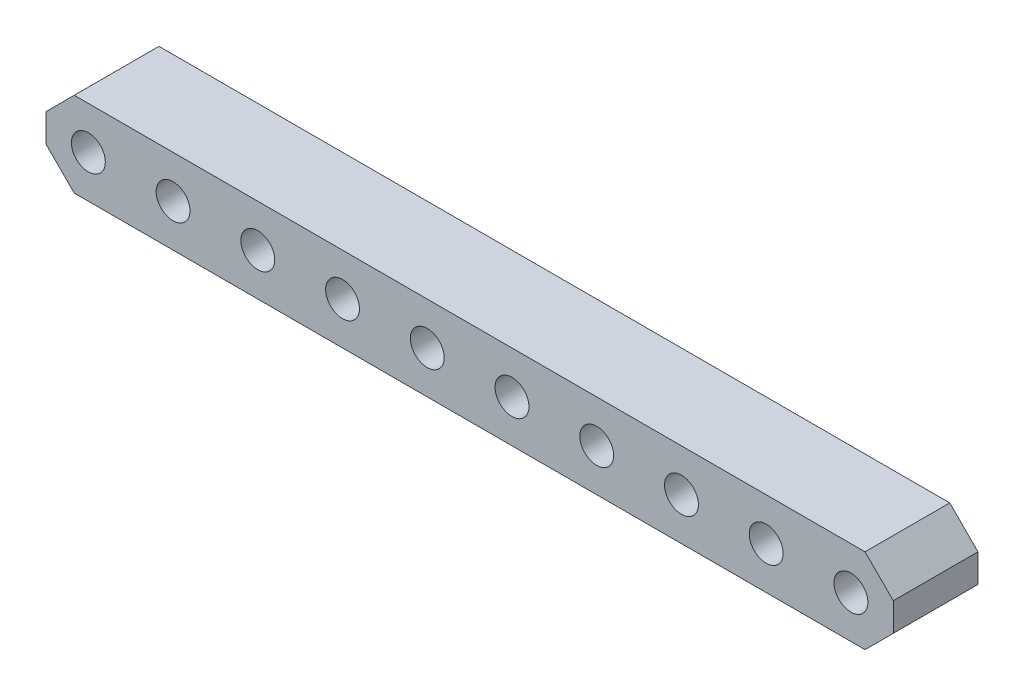
ISO-10303-21;
HEADER;
FILE_DESCRIPTION(('STEP AP214'),'2;1');
FILE_NAME('part.step','',(''),(''),'','','');
FILE_SCHEMA(('AUTOMOTIVE_DESIGN { 1 0 10303 214 1 1 1 1 }'));
ENDSEC;
DATA;
#1=APPLICATION_CONTEXT('core data for automotive mechanical design processes');
#2=APPLICATION_PROTOCOL_DEFINITION('international standard','automotive_design',2000,#1);
#3=PRODUCT_CONTEXT('',#1,'mechanical');
#4=PRODUCT('Part','Part','',(#3));
#5=PRODUCT_RELATED_PRODUCT_CATEGORY('part','',(#4));
#6=PRODUCT_DEFINITION_FORMATION('','',#4);
#7=PRODUCT_DEFINITION_CONTEXT('part definition',#1,'design');
#8=PRODUCT_DEFINITION('design','',#6,#7);
#9=PRODUCT_DEFINITION_SHAPE('','',#8);
#10=(LENGTH_UNIT() NAMED_UNIT(*) SI_UNIT(.MILLI.,.METRE.));
#11=(NAMED_UNIT(*) PLANE_ANGLE_UNIT() SI_UNIT($,.RADIAN.));
#12=(NAMED_UNIT(*) SI_UNIT($,.STERADIAN.) SOLID_ANGLE_UNIT());
#13=UNCERTAINTY_MEASURE_WITH_UNIT(LENGTH_MEASURE(1.E-05),#10,'distance_accuracy_value','');
#14=(GEOMETRIC_REPRESENTATION_CONTEXT(3) GLOBAL_UNCERTAINTY_ASSIGNED_CONTEXT((#13)) GLOBAL_UNIT_ASSIGNED_CONTEXT((#10,
#11,#12)) REPRESENTATION_CONTEXT('',''));
#15=CARTESIAN_POINT('',(0.,0.,0.));
#16=DIRECTION('',(0.,0.,1.));
#17=DIRECTION('',(1.,0.,0.));
#18=AXIS2_PLACEMENT_3D('',#15,#16,#17);
#19=CARTESIAN_POINT('',(0.,0.,18.));
#20=DIRECTION('',(0.,0.,1.));
#21=DIRECTION('',(1.,0.,0.));
#22=AXIS2_PLACEMENT_3D('',#19,#20,#21);
#23=PLANE('',#22);
#24=CARTESIAN_POINT('',(15.,0.,18.));
#25=DIRECTION('',(0.,0.,1.));
#26=DIRECTION('',(1.,0.,0.));
#27=AXIS2_PLACEMENT_3D('',#24,#25,#26);
#28=CIRCLE('',#27,6.);
#29=CARTESIAN_POINT('',(21.,0.,18.));
#30=VERTEX_POINT('',#29);
#31=EDGE_CURVE('E20',#30,#30,#28,.T.);
#32=ORIENTED_EDGE('',*,*,#31,.T.);
#33=EDGE_LOOP('',(#32));
#34=FACE_BOUND('',#33,.T.);
#35=ADVANCED_FACE('F17',(#34),#23,.T.);
#36=CARTESIAN_POINT('',(0.,0.,18.));
#37=DIRECTION('',(0.,0.,1.));
#38=DIRECTION('',(1.,0.,0.));
#39=AXIS2_PLACEMENT_3D('',#36,#37,#38);
#40=PLANE('',#39);
#41=CARTESIAN_POINT('',(45.,0.,18.));
#42=DIRECTION('',(0.,0.,1.));
#43=DIRECTION('',(1.,0.,0.));
#44=AXIS2_PLACEMENT_3D('',#41,#42,#43);
#45=CIRCLE('',#44,6.);
#46=CARTESIAN_POINT('',(51.,0.,18.));
#47=VERTEX_POINT('',#46);
#48=EDGE_CURVE('E161',#47,#47,#45,.T.);
#49=ORIENTED_EDGE('',*,*,#48,.T.);
#50=EDGE_LOOP('',(#49));
#51=FACE_BOUND('',#50,.T.);
#52=ADVANCED_FACE('F263',(#51),#40,.T.);
#53=CARTESIAN_POINT('',(0.,0.,18.));
#54=DIRECTION('',(0.,0.,1.));
#55=DIRECTION('',(1.,0.,0.));
#56=AXIS2_PLACEMENT_3D('',#53,#54,#55);
#57=PLANE('',#56);
#58=CARTESIAN_POINT('',(75.,0.,18.));
#59=DIRECTION('',(0.,0.,1.));
#60=DIRECTION('',(1.,0.,0.));
#61=AXIS2_PLACEMENT_3D('',#58,#59,#60);
#62=CIRCLE('',#61,6.);
#63=CARTESIAN_POINT('',(81.,0.,18.));
#64=VERTEX_POINT('',#63);
#65=EDGE_CURVE('E159',#64,#64,#62,.T.);
#66=ORIENTED_EDGE('',*,*,#65,.T.);
#67=EDGE_LOOP('',(#66));
#68=FACE_BOUND('',#67,.T.);
#69=ADVANCED_FACE('F260',(#68),#57,.T.);
#70=CARTESIAN_POINT('',(0.,0.,18.));
#71=DIRECTION('',(0.,0.,1.));
#72=DIRECTION('',(1.,0.,0.));
#73=AXIS2_PLACEMENT_3D('',#70,#71,#72);
#74=PLANE('',#73);
#75=CARTESIAN_POINT('',(105.,0.,18.));
#76=DIRECTION('',(0.,0.,1.));
#77=DIRECTION('',(1.,0.,0.));
#78=AXIS2_PLACEMENT_3D('',#75,#76,#77);
#79=CIRCLE('',#78,6.);
#80=CARTESIAN_POINT('',(111.,0.,18.));
#81=VERTEX_POINT('',#80);
#82=EDGE_CURVE('E156',#81,#81,#79,.T.);
#83=ORIENTED_EDGE('',*,*,#82,.T.);
#84=EDGE_LOOP('',(#83));
#85=FACE_BOUND('',#84,.T.);
#86=ADVANCED_FACE('F262',(#85),#74,.T.);
#87=CARTESIAN_POINT('',(0.,0.,18.));
#88=DIRECTION('',(0.,0.,1.));
#89=DIRECTION('',(1.,0.,0.));
#90=AXIS2_PLACEMENT_3D('',#87,#88,#89);
#91=PLANE('',#90);
#92=CARTESIAN_POINT('',(135.,0.,18.));
#93=DIRECTION('',(0.,0.,1.));
#94=DIRECTION('',(1.,0.,0.));
#95=AXIS2_PLACEMENT_3D('',#92,#93,#94);
#96=CIRCLE('',#95,6.);
#97=CARTESIAN_POINT('',(141.,0.,18.));
#98=VERTEX_POINT('',#97);
#99=EDGE_CURVE('E153',#98,#98,#96,.T.);
#100=ORIENTED_EDGE('',*,*,#99,.T.);
#101=EDGE_LOOP('',(#100));
#102=FACE_BOUND('',#101,.T.);
#103=ADVANCED_FACE('F269',(#102),#91,.T.);
#104=CARTESIAN_POINT('',(0.,0.,18.));
#105=DIRECTION('',(0.,0.,1.));
#106=DIRECTION('',(1.,0.,0.));
#107=AXIS2_PLACEMENT_3D('',#104,#105,#106);
#108=PLANE('',#107);
#109=CARTESIAN_POINT('',(-15.,0.,18.));
#110=DIRECTION('',(0.,0.,1.));
#111=DIRECTION('',(1.,0.,0.));
#112=AXIS2_PLACEMENT_3D('',#109,#110,#111);
#113=CIRCLE('',#112,6.);
#114=CARTESIAN_POINT('',(-9.,0.,18.));
#115=VERTEX_POINT('',#114);
#116=EDGE_CURVE('E150',#115,#115,#113,.T.);
#117=ORIENTED_EDGE('',*,*,#116,.T.);
#118=EDGE_LOOP('',(#117));
#119=FACE_BOUND('',#118,.T.);
#120=ADVANCED_FACE('F275',(#119),#108,.T.);
#121=CARTESIAN_POINT('',(0.,0.,18.));
#122=DIRECTION('',(0.,0.,1.));
#123=DIRECTION('',(1.,0.,0.));
#124=AXIS2_PLACEMENT_3D('',#121,#122,#123);
#125=PLANE('',#124);
#126=CARTESIAN_POINT('',(-45.,0.,18.));
#127=DIRECTION('',(0.,0.,1.));
#128=DIRECTION('',(1.,0.,0.));
#129=AXIS2_PLACEMENT_3D('',#126,#127,#128);
#130=CIRCLE('',#129,6.);
#131=CARTESIAN_POINT('',(-39.,0.,18.));
#132=VERTEX_POINT('',#131);
#133=EDGE_CURVE('E147',#132,#132,#130,.T.);
#134=ORIENTED_EDGE('',*,*,#133,.T.);
#135=EDGE_LOOP('',(#134));
#136=FACE_BOUND('',#135,.T.);
#137=ADVANCED_FACE('F279',(#136),#125,.T.);
#138=CARTESIAN_POINT('',(0.,0.,18.));
#139=DIRECTION('',(0.,0.,1.));
#140=DIRECTION('',(1.,0.,0.));
#141=AXIS2_PLACEMENT_3D('',#138,#139,#140);
#142=PLANE('',#141);
#143=CARTESIAN_POINT('',(-75.,0.,18.));
#144=DIRECTION('',(0.,0.,1.));
#145=DIRECTION('',(1.,0.,0.));
#146=AXIS2_PLACEMENT_3D('',#143,#144,#145);
#147=CIRCLE('',#146,6.);
#148=CARTESIAN_POINT('',(-69.,0.,18.));
#149=VERTEX_POINT('',#148);
#150=EDGE_CURVE('E144',#149,#149,#147,.T.);
#151=ORIENTED_EDGE('',*,*,#150,.T.);
#152=EDGE_LOOP('',(#151));
#153=FACE_BOUND('',#152,.T.);
#154=ADVANCED_FACE('F283',(#153),#142,.T.);
#155=CARTESIAN_POINT('',(0.,0.,18.));
#156=DIRECTION('',(0.,0.,1.));
#157=DIRECTION('',(1.,0.,0.));
#158=AXIS2_PLACEMENT_3D('',#155,#156,#157);
#159=PLANE('',#158);
#160=CARTESIAN_POINT('',(-105.,0.,18.));
#161=DIRECTION('',(0.,0.,1.));
#162=DIRECTION('',(1.,0.,0.));
#163=AXIS2_PLACEMENT_3D('',#160,#161,#162);
#164=CIRCLE('',#163,6.);
#165=CARTESIAN_POINT('',(-99.,0.,18.));
#166=VERTEX_POINT('',#165);
#167=EDGE_CURVE('E141',#166,#166,#164,.T.);
#168=ORIENTED_EDGE('',*,*,#167,.T.);
#169=EDGE_LOOP('',(#168));
#170=FACE_BOUND('',#169,.T.);
#171=ADVANCED_FACE('F183',(#170),#159,.T.);
#172=CARTESIAN_POINT('',(0.,0.,18.));
#173=DIRECTION('',(0.,0.,1.));
#174=DIRECTION('',(1.,0.,0.));
#175=AXIS2_PLACEMENT_3D('',#172,#173,#174);
#176=PLANE('',#175);
#177=CARTESIAN_POINT('',(-135.,0.,18.));
#178=DIRECTION('',(0.,0.,1.));
#179=DIRECTION('',(1.,0.,0.));
#180=AXIS2_PLACEMENT_3D('',#177,#178,#179);
#181=CIRCLE('',#180,6.);
#182=CARTESIAN_POINT('',(-129.,0.,18.));
#183=VERTEX_POINT('',#182);
#184=EDGE_CURVE('E138',#183,#183,#181,.T.);
#185=ORIENTED_EDGE('',*,*,#184,.T.);
#186=EDGE_LOOP('',(#185));
#187=FACE_BOUND('',#186,.T.);
#188=ADVANCED_FACE('F172',(#187),#176,.T.);
#189=CARTESIAN_POINT('',(15.,0.,24.));
#190=DIRECTION('',(0.,0.,1.));
#191=DIRECTION('',(1.,0.,0.));
#192=AXIS2_PLACEMENT_3D('',#189,#190,#191);
#193=CYLINDRICAL_SURFACE('',#192,6.);
#194=CARTESIAN_POINT('',(15.,0.,30.));
#195=DIRECTION('',(0.,0.,1.));
#196=DIRECTION('',(1.,0.,0.));
#197=AXIS2_PLACEMENT_3D('',#194,#195,#196);
#198=CIRCLE('',#197,6.);
#199=CARTESIAN_POINT('',(21.,0.,30.));
#200=VERTEX_POINT('',#199);
#201=EDGE_CURVE('E135',#200,#200,#198,.F.);
#202=ORIENTED_EDGE('',*,*,#201,.F.);
#203=EDGE_LOOP('',(#202));
#204=FACE_BOUND('',#203,.T.);
#205=ORIENTED_EDGE('',*,*,#31,.F.);
#206=EDGE_LOOP('',(#205));
#207=FACE_BOUND('',#206,.T.);
#208=ADVANCED_FACE('F169',(#204,#207),#193,.F.);
#209=CARTESIAN_POINT('',(45.,0.,24.));
#210=DIRECTION('',(0.,0.,1.));
#211=DIRECTION('',(1.,0.,0.));
#212=AXIS2_PLACEMENT_3D('',#209,#210,#211);
#213=CYLINDRICAL_SURFACE('',#212,6.);
#214=CARTESIAN_POINT('',(45.,0.,30.));
#215=DIRECTION('',(0.,0.,1.));
#216=DIRECTION('',(1.,0.,0.));
#217=AXIS2_PLACEMENT_3D('',#214,#215,#216);
#218=CIRCLE('',#217,6.);
#219=CARTESIAN_POINT('',(51.,0.,30.));
#220=VERTEX_POINT('',#219);
#221=EDGE_CURVE('E132',#220,#220,#218,.F.);
#222=ORIENTED_EDGE('',*,*,#221,.F.);
#223=EDGE_LOOP('',(#222));
#224=FACE_BOUND('',#223,.T.);
#225=ORIENTED_EDGE('',*,*,#48,.F.);
#226=EDGE_LOOP('',(#225));
#227=FACE_BOUND('',#226,.T.);
#228=ADVANCED_FACE('F171',(#224,#227),#213,.F.);
#229=CARTESIAN_POINT('',(75.,0.,24.));
#230=DIRECTION('',(0.,0.,1.));
#231=DIRECTION('',(1.,0.,0.));
#232=AXIS2_PLACEMENT_3D('',#229,#230,#231);
#233=CYLINDRICAL_SURFACE('',#232,6.);
#234=CARTESIAN_POINT('',(75.,0.,30.));
#235=DIRECTION('',(0.,0.,1.));
#236=DIRECTION('',(1.,0.,0.));
#237=AXIS2_PLACEMENT_3D('',#234,#235,#236);
#238=CIRCLE('',#237,6.);
#239=CARTESIAN_POINT('',(81.,0.,30.));
#240=VERTEX_POINT('',#239);
#241=EDGE_CURVE('E129',#240,#240,#238,.F.);
#242=ORIENTED_EDGE('',*,*,#241,.F.);
#243=EDGE_LOOP('',(#242));
#244=FACE_BOUND('',#243,.T.);
#245=ORIENTED_EDGE('',*,*,#65,.F.);
#246=EDGE_LOOP('',(#245));
#247=FACE_BOUND('',#246,.T.);
#248=ADVANCED_FACE('F180',(#244,#247),#233,.F.);
#249=CARTESIAN_POINT('',(105.,0.,24.));
#250=DIRECTION('',(0.,0.,1.));
#251=DIRECTION('',(1.,0.,0.));
#252=AXIS2_PLACEMENT_3D('',#249,#250,#251);
#253=CYLINDRICAL_SURFACE('',#252,6.);
#254=CARTESIAN_POINT('',(105.,0.,30.));
#255=DIRECTION('',(0.,0.,1.));
#256=DIRECTION('',(1.,0.,0.));
#257=AXIS2_PLACEMENT_3D('',#254,#255,#256);
#258=CIRCLE('',#257,6.);
#259=CARTESIAN_POINT('',(111.,0.,30.));
#260=VERTEX_POINT('',#259);
#261=EDGE_CURVE('E126',#260,#260,#258,.F.);
#262=ORIENTED_EDGE('',*,*,#261,.F.);
#263=EDGE_LOOP('',(#262));
#264=FACE_BOUND('',#263,.T.);
#265=ORIENTED_EDGE('',*,*,#82,.F.);
#266=EDGE_LOOP('',(#265));
#267=FACE_BOUND('',#266,.T.);
#268=ADVANCED_FACE('F247',(#264,#267),#253,.F.);
#269=CARTESIAN_POINT('',(135.,0.,24.));
#270=DIRECTION('',(0.,0.,1.));
#271=DIRECTION('',(1.,0.,0.));
#272=AXIS2_PLACEMENT_3D('',#269,#270,#271);
#273=CYLINDRICAL_SURFACE('',#272,6.);
#274=CARTESIAN_POINT('',(135.,0.,30.));
#275=DIRECTION('',(0.,0.,1.));
#276=DIRECTION('',(1.,0.,0.));
#277=AXIS2_PLACEMENT_3D('',#274,#275,#276);
#278=CIRCLE('',#277,6.);
#279=CARTESIAN_POINT('',(141.,0.,30.));
#280=VERTEX_POINT('',#279);
#281=EDGE_CURVE('E123',#280,#280,#278,.F.);
#282=ORIENTED_EDGE('',*,*,#281,.F.);
#283=EDGE_LOOP('',(#282));
#284=FACE_BOUND('',#283,.T.);
#285=ORIENTED_EDGE('',*,*,#99,.F.);
#286=EDGE_LOOP('',(#285));
#287=FACE_BOUND('',#286,.T.);
#288=ADVANCED_FACE('F243',(#284,#287),#273,.F.);
#289=CARTESIAN_POINT('',(-15.,0.,24.));
#290=DIRECTION('',(0.,0.,1.));
#291=DIRECTION('',(1.,0.,0.));
#292=AXIS2_PLACEMENT_3D('',#289,#290,#291);
#293=CYLINDRICAL_SURFACE('',#292,6.);
#294=CARTESIAN_POINT('',(-15.,0.,30.));
#295=DIRECTION('',(0.,0.,1.));
#296=DIRECTION('',(1.,0.,0.));
#297=AXIS2_PLACEMENT_3D('',#294,#295,#296);
#298=CIRCLE('',#297,6.);
#299=CARTESIAN_POINT('',(-9.,0.,30.));
#300=VERTEX_POINT('',#299);
#301=EDGE_CURVE('E120',#300,#300,#298,.F.);
#302=ORIENTED_EDGE('',*,*,#301,.F.);
#303=EDGE_LOOP('',(#302));
#304=FACE_BOUND('',#303,.T.);
#305=ORIENTED_EDGE('',*,*,#116,.F.);
#306=EDGE_LOOP('',(#305));
#307=FACE_BOUND('',#306,.T.);
#308=ADVANCED_FACE('F239',(#304,#307),#293,.F.);
#309=CARTESIAN_POINT('',(-45.,0.,24.));
#310=DIRECTION('',(0.,0.,1.));
#311=DIRECTION('',(1.,0.,0.));
#312=AXIS2_PLACEMENT_3D('',#309,#310,#311);
#313=CYLINDRICAL_SURFACE('',#312,6.);
#314=CARTESIAN_POINT('',(-45.,0.,30.));
#315=DIRECTION('',(0.,0.,1.));
#316=DIRECTION('',(1.,0.,0.));
#317=AXIS2_PLACEMENT_3D('',#314,#315,#316);
#318=CIRCLE('',#317,6.);
#319=CARTESIAN_POINT('',(-39.,0.,30.));
#320=VERTEX_POINT('',#319);
#321=EDGE_CURVE('E117',#320,#320,#318,.F.);
#322=ORIENTED_EDGE('',*,*,#321,.F.);
#323=EDGE_LOOP('',(#322));
#324=FACE_BOUND('',#323,.T.);
#325=ORIENTED_EDGE('',*,*,#133,.F.);
#326=EDGE_LOOP('',(#325));
#327=FACE_BOUND('',#326,.T.);
#328=ADVANCED_FACE('F235',(#324,#327),#313,.F.);
#329=CARTESIAN_POINT('',(-75.,0.,24.));
#330=DIRECTION('',(0.,0.,1.));
#331=DIRECTION('',(1.,0.,0.));
#332=AXIS2_PLACEMENT_3D('',#329,#330,#331);
#333=CYLINDRICAL_SURFACE('',#332,6.);
#334=CARTESIAN_POINT('',(-75.,0.,30.));
#335=DIRECTION('',(0.,0.,1.));
#336=DIRECTION('',(1.,0.,0.));
#337=AXIS2_PLACEMENT_3D('',#334,#335,#336);
#338=CIRCLE('',#337,6.);
#339=CARTESIAN_POINT('',(-69.,0.,30.));
#340=VERTEX_POINT('',#339);
#341=EDGE_CURVE('E114',#340,#340,#338,.F.);
#342=ORIENTED_EDGE('',*,*,#341,.F.);
#343=EDGE_LOOP('',(#342));
#344=FACE_BOUND('',#343,.T.);
#345=ORIENTED_EDGE('',*,*,#150,.F.);
#346=EDGE_LOOP('',(#345));
#347=FACE_BOUND('',#346,.T.);
#348=ADVANCED_FACE('F231',(#344,#347),#333,.F.);
#349=CARTESIAN_POINT('',(-105.,0.,24.));
#350=DIRECTION('',(0.,0.,1.));
#351=DIRECTION('',(1.,0.,0.));
#352=AXIS2_PLACEMENT_3D('',#349,#350,#351);
#353=CYLINDRICAL_SURFACE('',#352,6.);
#354=CARTESIAN_POINT('',(-105.,0.,30.));
#355=DIRECTION('',(0.,0.,1.));
#356=DIRECTION('',(1.,0.,0.));
#357=AXIS2_PLACEMENT_3D('',#354,#355,#356);
#358=CIRCLE('',#357,6.);
#359=CARTESIAN_POINT('',(-99.,0.,30.));
#360=VERTEX_POINT('',#359);
#361=EDGE_CURVE('E111',#360,#360,#358,.F.);
#362=ORIENTED_EDGE('',*,*,#361,.F.);
#363=EDGE_LOOP('',(#362));
#364=FACE_BOUND('',#363,.T.);
#365=ORIENTED_EDGE('',*,*,#167,.F.);
#366=EDGE_LOOP('',(#365));
#367=FACE_BOUND('',#366,.T.);
#368=ADVANCED_FACE('F227',(#364,#367),#353,.F.);
#369=CARTESIAN_POINT('',(-135.,0.,24.));
#370=DIRECTION('',(0.,0.,1.));
#371=DIRECTION('',(1.,0.,0.));
#372=AXIS2_PLACEMENT_3D('',#369,#370,#371);
#373=CYLINDRICAL_SURFACE('',#372,6.);
#374=CARTESIAN_POINT('',(-135.,0.,30.));
#375=DIRECTION('',(0.,0.,1.));
#376=DIRECTION('',(1.,0.,0.));
#377=AXIS2_PLACEMENT_3D('',#374,#375,#376);
#378=CIRCLE('',#377,6.);
#379=CARTESIAN_POINT('',(-129.,0.,30.));
#380=VERTEX_POINT('',#379);
#381=EDGE_CURVE('E95',#380,#380,#378,.F.);
#382=ORIENTED_EDGE('',*,*,#381,.F.);
#383=EDGE_LOOP('',(#382));
#384=FACE_BOUND('',#383,.T.);
#385=ORIENTED_EDGE('',*,*,#184,.F.);
#386=EDGE_LOOP('',(#385));
#387=FACE_BOUND('',#386,.T.);
#388=ADVANCED_FACE('F223',(#384,#387),#373,.F.);
#389=CARTESIAN_POINT('',(0.,0.,30.));
#390=DIRECTION('',(0.,0.,1.));
#391=DIRECTION('',(1.,0.,0.));
#392=AXIS2_PLACEMENT_3D('',#389,#390,#391);
#393=PLANE('',#392);
#394=ORIENTED_EDGE('',*,*,#381,.T.);
#395=EDGE_LOOP('',(#394));
#396=FACE_BOUND('',#395,.T.);
#397=ORIENTED_EDGE('',*,*,#361,.T.);
#398=EDGE_LOOP('',(#397));
#399=FACE_BOUND('',#398,.T.);
#400=ORIENTED_EDGE('',*,*,#341,.T.);
#401=EDGE_LOOP('',(#400));
#402=FACE_BOUND('',#401,.T.);
#403=ORIENTED_EDGE('',*,*,#321,.T.);
#404=EDGE_LOOP('',(#403));
#405=FACE_BOUND('',#404,.T.);
#406=ORIENTED_EDGE('',*,*,#301,.T.);
#407=EDGE_LOOP('',(#406));
#408=FACE_BOUND('',#407,.T.);
#409=ORIENTED_EDGE('',*,*,#281,.T.);
#410=EDGE_LOOP('',(#409));
#411=FACE_BOUND('',#410,.T.);
#412=ORIENTED_EDGE('',*,*,#261,.T.);
#413=EDGE_LOOP('',(#412));
#414=FACE_BOUND('',#413,.T.);
#415=ORIENTED_EDGE('',*,*,#241,.T.);
#416=EDGE_LOOP('',(#415));
#417=FACE_BOUND('',#416,.T.);
#418=ORIENTED_EDGE('',*,*,#221,.T.);
#419=EDGE_LOOP('',(#418));
#420=FACE_BOUND('',#419,.T.);
#421=ORIENTED_EDGE('',*,*,#201,.T.);
#422=EDGE_LOOP('',(#421));
#423=FACE_BOUND('',#422,.T.);
#424=DIRECTION('',(0.707106781186548,-0.707106781186548,0.));
#425=VECTOR('',#424,1.);
#426=CARTESIAN_POINT('',(140.,15.,30.));
#427=LINE('',#426,#425);
#428=CARTESIAN_POINT('',(150.,5.,30.));
#429=VERTEX_POINT('',#428);
#430=CARTESIAN_POINT('',(140.,15.,30.));
#431=VERTEX_POINT('',#430);
#432=EDGE_CURVE('E524',#429,#431,#427,.F.);
#433=ORIENTED_EDGE('',*,*,#432,.T.);
#434=DIRECTION('',(1.,0.,0.));
#435=VECTOR('',#434,1.);
#436=CARTESIAN_POINT('',(-140.,15.,30.));
#437=LINE('',#436,#435);
#438=CARTESIAN_POINT('',(-140.,15.,30.));
#439=VERTEX_POINT('',#438);
#440=EDGE_CURVE('E89',#431,#439,#437,.F.);
#441=ORIENTED_EDGE('',*,*,#440,.T.);
#442=DIRECTION('',(-0.707106781186548,-0.707106781186548,0.));
#443=VECTOR('',#442,1.);
#444=CARTESIAN_POINT('',(-140.,15.,30.));
#445=LINE('',#444,#443);
#446=CARTESIAN_POINT('',(-150.,5.00000000000001,30.));
#447=VERTEX_POINT('',#446);
#448=EDGE_CURVE('E83',#447,#439,#445,.F.);
#449=ORIENTED_EDGE('',*,*,#448,.F.);
#450=DIRECTION('',(0.,1.,0.));
#451=VECTOR('',#450,1.);
#452=CARTESIAN_POINT('',(-150.,5.,30.));
#453=LINE('',#452,#451);
#454=CARTESIAN_POINT('',(-150.,-5.,30.));
#455=VERTEX_POINT('',#454);
#456=EDGE_CURVE('E87',#455,#447,#453,.T.);
#457=ORIENTED_EDGE('',*,*,#456,.F.);
#458=DIRECTION('',(-0.707106781186548,0.707106781186548,0.));
#459=VECTOR('',#458,1.);
#460=CARTESIAN_POINT('',(-140.,-15.,30.));
#461=LINE('',#460,#459);
#462=CARTESIAN_POINT('',(-140.,-15.,30.));
#463=VERTEX_POINT('',#462);
#464=EDGE_CURVE('E78',#455,#463,#461,.F.);
#465=ORIENTED_EDGE('',*,*,#464,.T.);
#466=DIRECTION('',(1.,0.,0.));
#467=VECTOR('',#466,1.);
#468=CARTESIAN_POINT('',(140.,-15.,30.));
#469=LINE('',#468,#467);
#470=CARTESIAN_POINT('',(140.,-15.,30.));
#471=VERTEX_POINT('',#470);
#472=EDGE_CURVE('E537',#463,#471,#469,.T.);
#473=ORIENTED_EDGE('',*,*,#472,.T.);
#474=DIRECTION('',(0.707106781186548,0.707106781186548,0.));
#475=VECTOR('',#474,1.);
#476=CARTESIAN_POINT('',(140.,-15.,30.));
#477=LINE('',#476,#475);
#478=CARTESIAN_POINT('',(150.,-5.00000000000001,30.));
#479=VERTEX_POINT('',#478);
#480=EDGE_CURVE('E531',#479,#471,#477,.F.);
#481=ORIENTED_EDGE('',*,*,#480,.F.);
#482=DIRECTION('',(0.,1.,0.));
#483=VECTOR('',#482,1.);
#484=CARTESIAN_POINT('',(150.,-5.,30.));
#485=LINE('',#484,#483);
#486=EDGE_CURVE('E526',#429,#479,#485,.F.);
#487=ORIENTED_EDGE('',*,*,#486,.F.);
#488=EDGE_LOOP('',(#433,#441,#449,#457,#465,#473,#481,#487));
#489=FACE_BOUND('',#488,.T.);
#490=ADVANCED_FACE('F86',(#396,#399,#402,#405,#408,#411,#414,#417,#420,#423,#489),#393,.T.);
#491=CARTESIAN_POINT('',(-140.,15.,0.));
#492=DIRECTION('',(-0.707106781186548,0.707106781186548,0.));
#493=DIRECTION('',(-0.707106781186548,-0.707106781186548,0.));
#494=AXIS2_PLACEMENT_3D('',#491,#492,#493);
#495=PLANE('',#494);
#496=DIRECTION('',(0.,0.,1.));
#497=VECTOR('',#496,1.);
#498=CARTESIAN_POINT('',(-150.,5.,0.));
#499=LINE('',#498,#497);
#500=CARTESIAN_POINT('',(-150.,5.00000000000001,0.));
#501=VERTEX_POINT('',#500);
#502=EDGE_CURVE('E94',#447,#501,#499,.F.);
#503=ORIENTED_EDGE('',*,*,#502,.F.);
#504=ORIENTED_EDGE('',*,*,#448,.T.);
#505=DIRECTION('',(0.,0.,-1.));
#506=VECTOR('',#505,1.);
#507=CARTESIAN_POINT('',(-140.,15.,0.));
#508=LINE('',#507,#506);
#509=CARTESIAN_POINT('',(-140.,15.,0.));
#510=VERTEX_POINT('',#509);
#511=EDGE_CURVE('E518',#439,#510,#508,.T.);
#512=ORIENTED_EDGE('',*,*,#511,.T.);
#513=DIRECTION('',(-0.707106781186547,-0.707106781186548,0.));
#514=VECTOR('',#513,1.);
#515=CARTESIAN_POINT('',(-140.,15.,0.));
#516=LINE('',#515,#514);
#517=EDGE_CURVE('E105',#510,#501,#516,.T.);
#518=ORIENTED_EDGE('',*,*,#517,.T.);
#519=EDGE_LOOP('',(#503,#504,#512,#518));
#520=FACE_BOUND('',#519,.T.);
#521=ADVANCED_FACE('F104',(#520),#495,.T.);
#522=CARTESIAN_POINT('',(-150.,5.,0.));
#523=DIRECTION('',(-1.,0.,0.));
#524=DIRECTION('',(0.,0.,1.));
#525=AXIS2_PLACEMENT_3D('',#522,#523,#524);
#526=PLANE('',#525);
#527=DIRECTION('',(0.,0.,1.));
#528=VECTOR('',#527,1.);
#529=CARTESIAN_POINT('',(-150.,-5.00000000000001,0.));
#530=LINE('',#529,#528);
#531=CARTESIAN_POINT('',(-150.,-5.,0.));
#532=VERTEX_POINT('',#531);
#533=EDGE_CURVE('E101',#532,#455,#530,.T.);
#534=ORIENTED_EDGE('',*,*,#533,.T.);
#535=ORIENTED_EDGE('',*,*,#456,.T.);
#536=ORIENTED_EDGE('',*,*,#502,.T.);
#537=DIRECTION('',(0.,1.,0.));
#538=VECTOR('',#537,1.);
#539=CARTESIAN_POINT('',(-150.,0.,0.));
#540=LINE('',#539,#538);
#541=EDGE_CURVE('E508',#501,#532,#540,.F.);
#542=ORIENTED_EDGE('',*,*,#541,.T.);
#543=EDGE_LOOP('',(#534,#535,#536,#542));
#544=FACE_BOUND('',#543,.T.);
#545=ADVANCED_FACE('F98',(#544),#526,.T.);
#546=CARTESIAN_POINT('',(-140.,-15.,0.));
#547=DIRECTION('',(0.707106781186548,0.707106781186548,0.));
#548=DIRECTION('',(-0.707106781186548,0.707106781186548,0.));
#549=AXIS2_PLACEMENT_3D('',#546,#547,#548);
#550=PLANE('',#549);
#551=DIRECTION('',(0.707106781186547,-0.707106781186548,0.));
#552=VECTOR('',#551,1.);
#553=CARTESIAN_POINT('',(-150.,-5.,0.));
#554=LINE('',#553,#552);
#555=CARTESIAN_POINT('',(-140.,-15.,0.));
#556=VERTEX_POINT('',#555);
#557=EDGE_CURVE('E504',#532,#556,#554,.T.);
#558=ORIENTED_EDGE('',*,*,#557,.T.);
#559=DIRECTION('',(0.,0.,1.));
#560=VECTOR('',#559,1.);
#561=CARTESIAN_POINT('',(-140.,-15.,0.));
#562=LINE('',#561,#560);
#563=EDGE_CURVE('E505',#556,#463,#562,.T.);
#564=ORIENTED_EDGE('',*,*,#563,.T.);
#565=ORIENTED_EDGE('',*,*,#464,.F.);
#566=ORIENTED_EDGE('',*,*,#533,.F.);
#567=EDGE_LOOP('',(#558,#564,#565,#566));
#568=FACE_BOUND('',#567,.T.);
#569=ADVANCED_FACE('F213',(#568),#550,.F.);
#570=CARTESIAN_POINT('',(140.,-15.,0.));
#571=DIRECTION('',(0.,1.,0.));
#572=DIRECTION('',(0.,0.,1.));
#573=AXIS2_PLACEMENT_3D('',#570,#571,#572);
#574=PLANE('',#573);
#575=DIRECTION('',(1.,0.,0.));
#576=VECTOR('',#575,1.);
#577=CARTESIAN_POINT('',(0.,-15.,0.));
#578=LINE('',#577,#576);
#579=CARTESIAN_POINT('',(140.,-15.,0.));
#580=VERTEX_POINT('',#579);
#581=EDGE_CURVE('E507',#556,#580,#578,.T.);
#582=ORIENTED_EDGE('',*,*,#581,.T.);
#583=DIRECTION('',(0.,0.,1.));
#584=VECTOR('',#583,1.);
#585=CARTESIAN_POINT('',(140.,-15.,0.));
#586=LINE('',#585,#584);
#587=EDGE_CURVE('E534',#471,#580,#586,.F.);
#588=ORIENTED_EDGE('',*,*,#587,.F.);
#589=ORIENTED_EDGE('',*,*,#472,.F.);
#590=ORIENTED_EDGE('',*,*,#563,.F.);
#591=EDGE_LOOP('',(#582,#588,#589,#590));
#592=FACE_BOUND('',#591,.T.);
#593=ADVANCED_FACE('F209',(#592),#574,.F.);
#594=CARTESIAN_POINT('',(140.,-15.,0.));
#595=DIRECTION('',(0.707106781186548,-0.707106781186548,0.));
#596=DIRECTION('',(0.707106781186548,0.707106781186548,0.));
#597=AXIS2_PLACEMENT_3D('',#594,#595,#596);
#598=PLANE('',#597);
#599=DIRECTION('',(0.,0.,-1.));
#600=VECTOR('',#599,1.);
#601=CARTESIAN_POINT('',(150.,-5.,0.));
#602=LINE('',#601,#600);
#603=CARTESIAN_POINT('',(150.,-5.00000000000001,0.));
#604=VERTEX_POINT('',#603);
#605=EDGE_CURVE('E529',#479,#604,#602,.T.);
#606=ORIENTED_EDGE('',*,*,#605,.F.);
#607=ORIENTED_EDGE('',*,*,#480,.T.);
#608=ORIENTED_EDGE('',*,*,#587,.T.);
#609=DIRECTION('',(0.707106781186547,0.707106781186548,0.));
#610=VECTOR('',#609,1.);
#611=CARTESIAN_POINT('',(140.,-15.,0.));
#612=LINE('',#611,#610);
#613=EDGE_CURVE('E511',#580,#604,#612,.T.);
#614=ORIENTED_EDGE('',*,*,#613,.T.);
#615=EDGE_LOOP('',(#606,#607,#608,#614));
#616=FACE_BOUND('',#615,.T.);
#617=ADVANCED_FACE('F205',(#616),#598,.T.);
#618=CARTESIAN_POINT('',(150.,-5.,0.));
#619=DIRECTION('',(1.,0.,0.));
#620=DIRECTION('',(0.,0.,-1.));
#621=AXIS2_PLACEMENT_3D('',#618,#619,#620);
#622=PLANE('',#621);
#623=DIRECTION('',(0.,0.,1.));
#624=VECTOR('',#623,1.);
#625=CARTESIAN_POINT('',(150.,5.00000000000001,0.));
#626=LINE('',#625,#624);
#627=CARTESIAN_POINT('',(150.,5.,0.));
#628=VERTEX_POINT('',#627);
#629=EDGE_CURVE('E521',#628,#429,#626,.T.);
#630=ORIENTED_EDGE('',*,*,#629,.T.);
#631=ORIENTED_EDGE('',*,*,#486,.T.);
#632=ORIENTED_EDGE('',*,*,#605,.T.);
#633=DIRECTION('',(0.,1.,0.));
#634=VECTOR('',#633,1.);
#635=CARTESIAN_POINT('',(150.,0.,0.));
#636=LINE('',#635,#634);
#637=EDGE_CURVE('E546',#604,#628,#636,.T.);
#638=ORIENTED_EDGE('',*,*,#637,.T.);
#639=EDGE_LOOP('',(#630,#631,#632,#638));
#640=FACE_BOUND('',#639,.T.);
#641=ADVANCED_FACE('F201',(#640),#622,.T.);
#642=CARTESIAN_POINT('',(140.,15.,0.));
#643=DIRECTION('',(-0.707106781186548,-0.707106781186548,0.));
#644=DIRECTION('',(0.707106781186548,-0.707106781186548,0.));
#645=AXIS2_PLACEMENT_3D('',#642,#643,#644);
#646=PLANE('',#645);
#647=DIRECTION('',(-0.707106781186547,0.707106781186548,0.));
#648=VECTOR('',#647,1.);
#649=CARTESIAN_POINT('',(150.,5.,0.));
#650=LINE('',#649,#648);
#651=CARTESIAN_POINT('',(140.,15.,0.));
#652=VERTEX_POINT('',#651);
#653=EDGE_CURVE('E26',#628,#652,#650,.T.);
#654=ORIENTED_EDGE('',*,*,#653,.T.);
#655=DIRECTION('',(0.,0.,-1.));
#656=VECTOR('',#655,1.);
#657=CARTESIAN_POINT('',(140.,15.,0.));
#658=LINE('',#657,#656);
#659=EDGE_CURVE('E34',#652,#431,#658,.F.);
#660=ORIENTED_EDGE('',*,*,#659,.T.);
#661=ORIENTED_EDGE('',*,*,#432,.F.);
#662=ORIENTED_EDGE('',*,*,#629,.F.);
#663=EDGE_LOOP('',(#654,#660,#661,#662));
#664=FACE_BOUND('',#663,.T.);
#665=ADVANCED_FACE('F195',(#664),#646,.F.);
#666=CARTESIAN_POINT('',(-140.,15.,0.));
#667=DIRECTION('',(0.,-1.,0.));
#668=DIRECTION('',(0.,0.,-1.));
#669=AXIS2_PLACEMENT_3D('',#666,#667,#668);
#670=PLANE('',#669);
#671=DIRECTION('',(1.,0.,0.));
#672=VECTOR('',#671,1.);
#673=CARTESIAN_POINT('',(0.,15.,0.));
#674=LINE('',#673,#672);
#675=EDGE_CURVE('E11',#652,#510,#674,.F.);
#676=ORIENTED_EDGE('',*,*,#675,.T.);
#677=ORIENTED_EDGE('',*,*,#511,.F.);
#678=ORIENTED_EDGE('',*,*,#440,.F.);
#679=ORIENTED_EDGE('',*,*,#659,.F.);
#680=EDGE_LOOP('',(#676,#677,#678,#679));
#681=FACE_BOUND('',#680,.T.);
#682=ADVANCED_FACE('F189',(#681),#670,.F.);
#683=CARTESIAN_POINT('',(0.,0.,0.));
#684=DIRECTION('',(0.,0.,1.));
#685=DIRECTION('',(1.,0.,0.));
#686=AXIS2_PLACEMENT_3D('',#683,#684,#685);
#687=PLANE('',#686);
#688=ORIENTED_EDGE('',*,*,#653,.F.);
#689=ORIENTED_EDGE('',*,*,#637,.F.);
#690=ORIENTED_EDGE('',*,*,#613,.F.);
#691=ORIENTED_EDGE('',*,*,#581,.F.);
#692=ORIENTED_EDGE('',*,*,#557,.F.);
#693=ORIENTED_EDGE('',*,*,#541,.F.);
#694=ORIENTED_EDGE('',*,*,#517,.F.);
#695=ORIENTED_EDGE('',*,*,#675,.F.);
#696=EDGE_LOOP('',(#688,#689,#690,#691,#692,#693,#694,#695));
#697=FACE_BOUND('',#696,.T.);
#698=ADVANCED_FACE('F187',(#697),#687,.F.);
#699=CLOSED_SHELL('',(#35,#52,#69,#86,#103,#120,#137,#154,#171,#188,#208,#228,#248,#268,#288,
#308,#328,#348,#368,#388,#490,#521,#545,#569,#593,#617,#641,#665,#682,#698));
#700=MANIFOLD_SOLID_BREP('B1',#699);
#701=ADVANCED_BREP_SHAPE_REPRESENTATION('',(#18,#700),#14);
#702=SHAPE_DEFINITION_REPRESENTATION(#9,#701);
ENDSEC;
END-ISO-10303-21;
